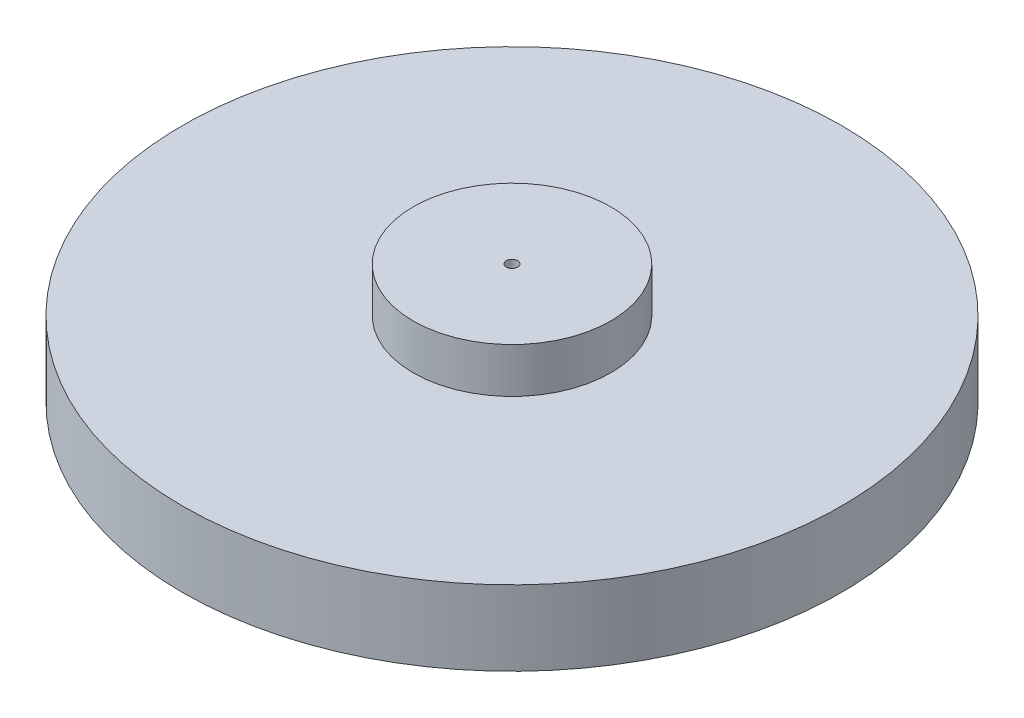
ISO-10303-21;
HEADER;
FILE_DESCRIPTION(('STEP AP214'),'2;1');
FILE_NAME('part.step','',(''),(''),'','','');
FILE_SCHEMA(('AUTOMOTIVE_DESIGN { 1 0 10303 214 1 1 1 1 }'));
ENDSEC;
DATA;
#1=APPLICATION_CONTEXT('core data for automotive mechanical design processes');
#2=APPLICATION_PROTOCOL_DEFINITION('international standard','automotive_design',2000,#1);
#3=PRODUCT_CONTEXT('',#1,'mechanical');
#4=PRODUCT('Part','Part','',(#3));
#5=PRODUCT_RELATED_PRODUCT_CATEGORY('part','',(#4));
#6=PRODUCT_DEFINITION_FORMATION('','',#4);
#7=PRODUCT_DEFINITION_CONTEXT('part definition',#1,'design');
#8=PRODUCT_DEFINITION('design','',#6,#7);
#9=PRODUCT_DEFINITION_SHAPE('','',#8);
#10=(LENGTH_UNIT() NAMED_UNIT(*) SI_UNIT(.MILLI.,.METRE.));
#11=(NAMED_UNIT(*) PLANE_ANGLE_UNIT() SI_UNIT($,.RADIAN.));
#12=(NAMED_UNIT(*) SI_UNIT($,.STERADIAN.) SOLID_ANGLE_UNIT());
#13=UNCERTAINTY_MEASURE_WITH_UNIT(LENGTH_MEASURE(1.E-05),#10,'distance_accuracy_value','');
#14=(GEOMETRIC_REPRESENTATION_CONTEXT(3) GLOBAL_UNCERTAINTY_ASSIGNED_CONTEXT((#13)) GLOBAL_UNIT_ASSIGNED_CONTEXT((#10,
#11,#12)) REPRESENTATION_CONTEXT('',''));
#15=CARTESIAN_POINT('',(0.,0.,0.));
#16=DIRECTION('',(0.,0.,1.));
#17=DIRECTION('',(1.,0.,0.));
#18=AXIS2_PLACEMENT_3D('',#15,#16,#17);
#19=CARTESIAN_POINT('',(0.,15.875,0.));
#20=DIRECTION('',(0.,-1.,0.));
#21=DIRECTION('',(0.,0.,-1.));
#22=AXIS2_PLACEMENT_3D('',#19,#20,#21);
#23=CYLINDRICAL_SURFACE('',#22,69.85);
#24=CARTESIAN_POINT('',(0.,15.875,0.));
#25=DIRECTION('',(0.,1.,0.));
#26=DIRECTION('',(0.,0.,1.));
#27=AXIS2_PLACEMENT_3D('',#24,#25,#26);
#28=CIRCLE('',#27,69.85);
#29=CARTESIAN_POINT('',(0.,15.875,69.85));
#30=VERTEX_POINT('',#29);
#31=EDGE_CURVE('E63',#30,#30,#28,.T.);
#32=ORIENTED_EDGE('',*,*,#31,.F.);
#33=EDGE_LOOP('',(#32));
#34=FACE_BOUND('',#33,.T.);
#35=CARTESIAN_POINT('',(0.,0.,0.));
#36=DIRECTION('',(0.,1.,0.));
#37=DIRECTION('',(0.,0.,1.));
#38=AXIS2_PLACEMENT_3D('',#35,#36,#37);
#39=CIRCLE('',#38,69.85);
#40=CARTESIAN_POINT('',(0.,0.,69.85));
#41=VERTEX_POINT('',#40);
#42=EDGE_CURVE('E58',#41,#41,#39,.T.);
#43=ORIENTED_EDGE('',*,*,#42,.T.);
#44=EDGE_LOOP('',(#43));
#45=FACE_BOUND('',#44,.T.);
#46=ADVANCED_FACE('F55',(#34,#45),#23,.T.);
#47=CARTESIAN_POINT('',(0.,15.875,0.));
#48=DIRECTION('',(0.,1.,0.));
#49=DIRECTION('',(0.,0.,1.));
#50=AXIS2_PLACEMENT_3D('',#47,#48,#49);
#51=PLANE('',#50);
#52=CARTESIAN_POINT('',(0.,15.875,0.));
#53=DIRECTION('',(0.,1.,0.));
#54=DIRECTION('',(0.,0.,1.));
#55=AXIS2_PLACEMENT_3D('',#52,#53,#54);
#56=CIRCLE('',#55,20.955);
#57=CARTESIAN_POINT('',(0.,15.875,20.955));
#58=VERTEX_POINT('',#57);
#59=EDGE_CURVE('E11',#58,#58,#56,.T.);
#60=ORIENTED_EDGE('',*,*,#59,.F.);
#61=EDGE_LOOP('',(#60));
#62=FACE_BOUND('',#61,.T.);
#63=ORIENTED_EDGE('',*,*,#31,.T.);
#64=EDGE_LOOP('',(#63));
#65=FACE_BOUND('',#64,.T.);
#66=ADVANCED_FACE('F167',(#62,#65),#51,.T.);
#67=CARTESIAN_POINT('',(0.,0.,0.));
#68=DIRECTION('',(0.,1.,0.));
#69=DIRECTION('',(0.,0.,1.));
#70=AXIS2_PLACEMENT_3D('',#67,#68,#69);
#71=PLANE('',#70);
#72=CARTESIAN_POINT('',(0.,0.,0.));
#73=DIRECTION('',(0.,-1.,0.));
#74=DIRECTION('',(0.,0.,-1.));
#75=AXIS2_PLACEMENT_3D('',#72,#73,#74);
#76=CIRCLE('',#75,41.275);
#77=CARTESIAN_POINT('',(0.,0.,-41.275));
#78=VERTEX_POINT('',#77);
#79=EDGE_CURVE('E75',#78,#78,#76,.T.);
#80=ORIENTED_EDGE('',*,*,#79,.F.);
#81=EDGE_LOOP('',(#80));
#82=FACE_BOUND('',#81,.T.);
#83=ORIENTED_EDGE('',*,*,#42,.F.);
#84=EDGE_LOOP('',(#83));
#85=FACE_BOUND('',#84,.T.);
#86=ADVANCED_FACE('F149',(#82,#85),#71,.F.);
#87=CARTESIAN_POINT('',(0.,25.4,0.));
#88=DIRECTION('',(0.,-1.,0.));
#89=DIRECTION('',(0.,0.,-1.));
#90=AXIS2_PLACEMENT_3D('',#87,#88,#89);
#91=CYLINDRICAL_SURFACE('',#90,20.955);
#92=CARTESIAN_POINT('',(0.,25.4,0.));
#93=DIRECTION('',(0.,1.,0.));
#94=DIRECTION('',(0.,0.,1.));
#95=AXIS2_PLACEMENT_3D('',#92,#93,#94);
#96=CIRCLE('',#95,20.955);
#97=CARTESIAN_POINT('',(0.,25.4,20.955));
#98=VERTEX_POINT('',#97);
#99=EDGE_CURVE('E70',#98,#98,#96,.T.);
#100=ORIENTED_EDGE('',*,*,#99,.F.);
#101=EDGE_LOOP('',(#100));
#102=FACE_BOUND('',#101,.T.);
#103=ORIENTED_EDGE('',*,*,#59,.T.);
#104=EDGE_LOOP('',(#103));
#105=FACE_BOUND('',#104,.T.);
#106=ADVANCED_FACE('F181',(#102,#105),#91,.T.);
#107=CARTESIAN_POINT('',(0.,25.4,0.));
#108=DIRECTION('',(0.,1.,0.));
#109=DIRECTION('',(0.,0.,1.));
#110=AXIS2_PLACEMENT_3D('',#107,#108,#109);
#111=PLANE('',#110);
#112=CARTESIAN_POINT('',(0.,25.4,0.));
#113=DIRECTION('',(0.,-1.,0.));
#114=DIRECTION('',(0.,0.,-1.));
#115=AXIS2_PLACEMENT_3D('',#112,#113,#114);
#116=CIRCLE('',#115,1.190625);
#117=CARTESIAN_POINT('',(0.,25.4,-1.190625));
#118=VERTEX_POINT('',#117);
#119=EDGE_CURVE('E111',#118,#118,#116,.T.);
#120=ORIENTED_EDGE('',*,*,#119,.T.);
#121=EDGE_LOOP('',(#120));
#122=FACE_BOUND('',#121,.T.);
#123=ORIENTED_EDGE('',*,*,#99,.T.);
#124=EDGE_LOOP('',(#123));
#125=FACE_BOUND('',#124,.T.);
#126=ADVANCED_FACE('F123',(#122,#125),#111,.T.);
#127=CARTESIAN_POINT('',(0.,6.35,0.));
#128=DIRECTION('',(0.,-1.,0.));
#129=DIRECTION('',(0.,0.,-1.));
#130=AXIS2_PLACEMENT_3D('',#127,#128,#129);
#131=CYLINDRICAL_SURFACE('',#130,33.02);
#132=CARTESIAN_POINT('',(0.,6.35,0.));
#133=DIRECTION('',(0.,-1.,0.));
#134=DIRECTION('',(0.,0.,-1.));
#135=AXIS2_PLACEMENT_3D('',#132,#133,#134);
#136=CIRCLE('',#135,33.02);
#137=CARTESIAN_POINT('',(0.,6.35,-33.02));
#138=VERTEX_POINT('',#137);
#139=EDGE_CURVE('E79',#138,#138,#136,.T.);
#140=ORIENTED_EDGE('',*,*,#139,.T.);
#141=EDGE_LOOP('',(#140));
#142=FACE_BOUND('',#141,.T.);
#143=CARTESIAN_POINT('',(0.,0.,0.));
#144=DIRECTION('',(0.,-1.,0.));
#145=DIRECTION('',(0.,0.,-1.));
#146=AXIS2_PLACEMENT_3D('',#143,#144,#145);
#147=CIRCLE('',#146,33.02);
#148=CARTESIAN_POINT('',(0.,0.,-33.02));
#149=VERTEX_POINT('',#148);
#150=EDGE_CURVE('E80',#149,#149,#147,.T.);
#151=ORIENTED_EDGE('',*,*,#150,.F.);
#152=EDGE_LOOP('',(#151));
#153=FACE_BOUND('',#152,.T.);
#154=ADVANCED_FACE('F192',(#142,#153),#131,.T.);
#155=CARTESIAN_POINT('',(0.,6.35,0.));
#156=DIRECTION('',(0.,-1.,0.));
#157=DIRECTION('',(0.,0.,-1.));
#158=AXIS2_PLACEMENT_3D('',#155,#156,#157);
#159=CYLINDRICAL_SURFACE('',#158,41.275);
#160=CARTESIAN_POINT('',(0.,6.35,0.));
#161=DIRECTION('',(0.,-1.,0.));
#162=DIRECTION('',(0.,0.,-1.));
#163=AXIS2_PLACEMENT_3D('',#160,#161,#162);
#164=CIRCLE('',#163,41.275);
#165=CARTESIAN_POINT('',(0.,6.35,-41.275));
#166=VERTEX_POINT('',#165);
#167=EDGE_CURVE('E74',#166,#166,#164,.T.);
#168=ORIENTED_EDGE('',*,*,#167,.F.);
#169=EDGE_LOOP('',(#168));
#170=FACE_BOUND('',#169,.T.);
#171=ORIENTED_EDGE('',*,*,#79,.T.);
#172=EDGE_LOOP('',(#171));
#173=FACE_BOUND('',#172,.T.);
#174=ADVANCED_FACE('F195',(#170,#173),#159,.F.);
#175=CARTESIAN_POINT('',(0.,6.35,0.));
#176=DIRECTION('',(0.,-1.,0.));
#177=DIRECTION('',(0.,0.,-1.));
#178=AXIS2_PLACEMENT_3D('',#175,#176,#177);
#179=PLANE('',#178);
#180=ORIENTED_EDGE('',*,*,#139,.F.);
#181=EDGE_LOOP('',(#180));
#182=FACE_BOUND('',#181,.T.);
#183=ORIENTED_EDGE('',*,*,#167,.T.);
#184=EDGE_LOOP('',(#183));
#185=FACE_BOUND('',#184,.T.);
#186=ADVANCED_FACE('F163',(#182,#185),#179,.T.);
#187=CARTESIAN_POINT('',(0.,0.,0.));
#188=DIRECTION('',(0.,-1.,0.));
#189=DIRECTION('',(0.,0.,-1.));
#190=AXIS2_PLACEMENT_3D('',#187,#188,#189);
#191=CIRCLE('',#190,25.4);
#192=CARTESIAN_POINT('',(0.,0.,-25.4));
#193=VERTEX_POINT('',#192);
#194=EDGE_CURVE('E91',#193,#193,#191,.T.);
#195=ORIENTED_EDGE('',*,*,#194,.F.);
#196=EDGE_LOOP('',(#195));
#197=FACE_BOUND('',#196,.T.);
#198=ORIENTED_EDGE('',*,*,#150,.T.);
#199=EDGE_LOOP('',(#198));
#200=FACE_BOUND('',#199,.T.);
#201=ADVANCED_FACE('F148',(#197,#200),#71,.F.);
#202=CARTESIAN_POINT('',(0.,6.35,0.));
#203=DIRECTION('',(0.,-1.,0.));
#204=DIRECTION('',(0.,0.,-1.));
#205=AXIS2_PLACEMENT_3D('',#202,#203,#204);
#206=CYLINDRICAL_SURFACE('',#205,14.2875);
#207=CARTESIAN_POINT('',(0.,6.35,0.));
#208=DIRECTION('',(0.,-1.,0.));
#209=DIRECTION('',(0.,0.,-1.));
#210=AXIS2_PLACEMENT_3D('',#207,#208,#209);
#211=CIRCLE('',#210,14.2875);
#212=CARTESIAN_POINT('',(0.,6.35,-14.2875));
#213=VERTEX_POINT('',#212);
#214=EDGE_CURVE('E95',#213,#213,#211,.T.);
#215=ORIENTED_EDGE('',*,*,#214,.T.);
#216=EDGE_LOOP('',(#215));
#217=FACE_BOUND('',#216,.T.);
#218=CARTESIAN_POINT('',(0.,0.,0.));
#219=DIRECTION('',(0.,-1.,0.));
#220=DIRECTION('',(0.,0.,-1.));
#221=AXIS2_PLACEMENT_3D('',#218,#219,#220);
#222=CIRCLE('',#221,14.2875);
#223=CARTESIAN_POINT('',(0.,0.,-14.2875));
#224=VERTEX_POINT('',#223);
#225=EDGE_CURVE('E96',#224,#224,#222,.T.);
#226=ORIENTED_EDGE('',*,*,#225,.F.);
#227=EDGE_LOOP('',(#226));
#228=FACE_BOUND('',#227,.T.);
#229=ADVANCED_FACE('F152',(#217,#228),#206,.T.);
#230=CARTESIAN_POINT('',(0.,6.35,0.));
#231=DIRECTION('',(0.,-1.,0.));
#232=DIRECTION('',(0.,0.,-1.));
#233=AXIS2_PLACEMENT_3D('',#230,#231,#232);
#234=CYLINDRICAL_SURFACE('',#233,25.4);
#235=CARTESIAN_POINT('',(0.,6.35,0.));
#236=DIRECTION('',(0.,-1.,0.));
#237=DIRECTION('',(0.,0.,-1.));
#238=AXIS2_PLACEMENT_3D('',#235,#236,#237);
#239=CIRCLE('',#238,25.4);
#240=CARTESIAN_POINT('',(0.,6.35,-25.4));
#241=VERTEX_POINT('',#240);
#242=EDGE_CURVE('E84',#241,#241,#239,.T.);
#243=ORIENTED_EDGE('',*,*,#242,.F.);
#244=EDGE_LOOP('',(#243));
#245=FACE_BOUND('',#244,.T.);
#246=ORIENTED_EDGE('',*,*,#194,.T.);
#247=EDGE_LOOP('',(#246));
#248=FACE_BOUND('',#247,.T.);
#249=ADVANCED_FACE('F154',(#245,#248),#234,.F.);
#250=CARTESIAN_POINT('',(0.,6.35,0.));
#251=DIRECTION('',(0.,-1.,0.));
#252=DIRECTION('',(0.,0.,-1.));
#253=AXIS2_PLACEMENT_3D('',#250,#251,#252);
#254=PLANE('',#253);
#255=ORIENTED_EDGE('',*,*,#214,.F.);
#256=EDGE_LOOP('',(#255));
#257=FACE_BOUND('',#256,.T.);
#258=ORIENTED_EDGE('',*,*,#242,.T.);
#259=EDGE_LOOP('',(#258));
#260=FACE_BOUND('',#259,.T.);
#261=ADVANCED_FACE('F147',(#257,#260),#254,.T.);
#262=CARTESIAN_POINT('',(0.,0.,0.));
#263=DIRECTION('',(0.,-1.,0.));
#264=DIRECTION('',(0.,0.,-1.));
#265=AXIS2_PLACEMENT_3D('',#262,#263,#264);
#266=CIRCLE('',#265,7.62);
#267=CARTESIAN_POINT('',(0.,0.,-7.62));
#268=VERTEX_POINT('',#267);
#269=EDGE_CURVE('E107',#268,#268,#266,.T.);
#270=ORIENTED_EDGE('',*,*,#269,.F.);
#271=EDGE_LOOP('',(#270));
#272=FACE_BOUND('',#271,.T.);
#273=ORIENTED_EDGE('',*,*,#225,.T.);
#274=EDGE_LOOP('',(#273));
#275=FACE_BOUND('',#274,.T.);
#276=ADVANCED_FACE('F141',(#272,#275),#71,.F.);
#277=CARTESIAN_POINT('',(0.,6.35,0.));
#278=DIRECTION('',(0.,-1.,0.));
#279=DIRECTION('',(0.,0.,-1.));
#280=AXIS2_PLACEMENT_3D('',#277,#278,#279);
#281=CYLINDRICAL_SURFACE('',#280,7.62);
#282=CARTESIAN_POINT('',(0.,6.35,0.));
#283=DIRECTION('',(0.,-1.,0.));
#284=DIRECTION('',(0.,0.,-1.));
#285=AXIS2_PLACEMENT_3D('',#282,#283,#284);
#286=CIRCLE('',#285,7.62);
#287=CARTESIAN_POINT('',(0.,6.35,-7.62));
#288=VERTEX_POINT('',#287);
#289=EDGE_CURVE('E100',#288,#288,#286,.T.);
#290=ORIENTED_EDGE('',*,*,#289,.F.);
#291=EDGE_LOOP('',(#290));
#292=FACE_BOUND('',#291,.T.);
#293=ORIENTED_EDGE('',*,*,#269,.T.);
#294=EDGE_LOOP('',(#293));
#295=FACE_BOUND('',#294,.T.);
#296=ADVANCED_FACE('F135',(#292,#295),#281,.F.);
#297=CARTESIAN_POINT('',(0.,6.35,0.));
#298=DIRECTION('',(0.,-1.,0.));
#299=DIRECTION('',(0.,0.,-1.));
#300=AXIS2_PLACEMENT_3D('',#297,#298,#299);
#301=PLANE('',#300);
#302=CARTESIAN_POINT('',(0.,6.35,0.));
#303=DIRECTION('',(0.,-1.,0.));
#304=DIRECTION('',(0.,0.,-1.));
#305=AXIS2_PLACEMENT_3D('',#302,#303,#304);
#306=CIRCLE('',#305,1.190625);
#307=CARTESIAN_POINT('',(0.,6.35,-1.190625));
#308=VERTEX_POINT('',#307);
#309=EDGE_CURVE('E115',#308,#308,#306,.T.);
#310=ORIENTED_EDGE('',*,*,#309,.F.);
#311=EDGE_LOOP('',(#310));
#312=FACE_BOUND('',#311,.T.);
#313=ORIENTED_EDGE('',*,*,#289,.T.);
#314=EDGE_LOOP('',(#313));
#315=FACE_BOUND('',#314,.T.);
#316=ADVANCED_FACE('F129',(#312,#315),#301,.T.);
#317=CARTESIAN_POINT('',(0.,25.4,0.));
#318=DIRECTION('',(0.,-1.,0.));
#319=DIRECTION('',(0.,0.,-1.));
#320=AXIS2_PLACEMENT_3D('',#317,#318,#319);
#321=CYLINDRICAL_SURFACE('',#320,1.190625);
#322=ORIENTED_EDGE('',*,*,#119,.F.);
#323=EDGE_LOOP('',(#322));
#324=FACE_BOUND('',#323,.T.);
#325=ORIENTED_EDGE('',*,*,#309,.T.);
#326=EDGE_LOOP('',(#325));
#327=FACE_BOUND('',#326,.T.);
#328=ADVANCED_FACE('F126',(#324,#327),#321,.F.);
#329=CLOSED_SHELL('',(#46,#66,#86,#106,#126,#154,#174,#186,#201,#229,#249,#261,#276,#296,#316,#328));
#330=MANIFOLD_SOLID_BREP('B2',#329);
#331=ADVANCED_BREP_SHAPE_REPRESENTATION('',(#18,#330),#14);
#332=SHAPE_DEFINITION_REPRESENTATION(#9,#331);
ENDSEC;
END-ISO-10303-21;
